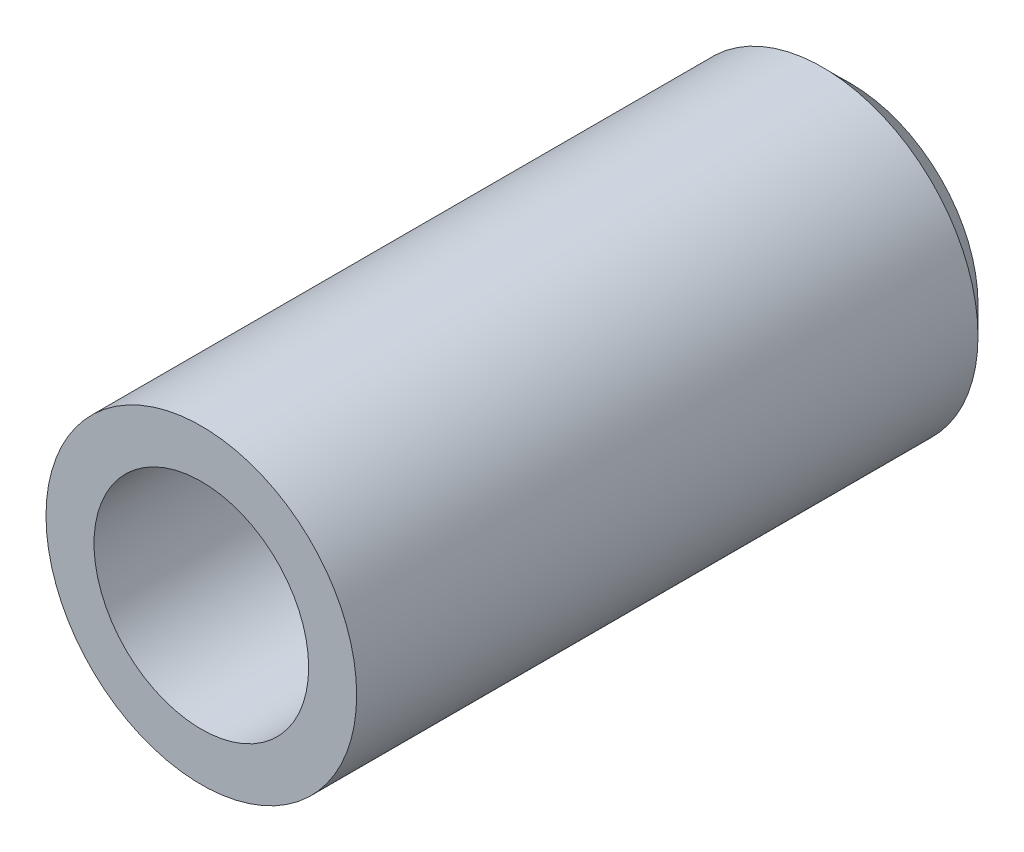
ISO-10303-21;
HEADER;
FILE_DESCRIPTION(('STEP AP214'),'2;1');
FILE_NAME('part.step','',(''),(''),'','','');
FILE_SCHEMA(('AUTOMOTIVE_DESIGN { 1 0 10303 214 1 1 1 1 }'));
ENDSEC;
DATA;
#1=APPLICATION_CONTEXT('core data for automotive mechanical design processes');
#2=APPLICATION_PROTOCOL_DEFINITION('international standard','automotive_design',2000,#1);
#3=PRODUCT_CONTEXT('',#1,'mechanical');
#4=PRODUCT('Part','Part','',(#3));
#5=PRODUCT_RELATED_PRODUCT_CATEGORY('part','',(#4));
#6=PRODUCT_DEFINITION_FORMATION('','',#4);
#7=PRODUCT_DEFINITION_CONTEXT('part definition',#1,'design');
#8=PRODUCT_DEFINITION('design','',#6,#7);
#9=PRODUCT_DEFINITION_SHAPE('','',#8);
#10=(LENGTH_UNIT() NAMED_UNIT(*) SI_UNIT(.MILLI.,.METRE.));
#11=(NAMED_UNIT(*) PLANE_ANGLE_UNIT() SI_UNIT($,.RADIAN.));
#12=(NAMED_UNIT(*) SI_UNIT($,.STERADIAN.) SOLID_ANGLE_UNIT());
#13=UNCERTAINTY_MEASURE_WITH_UNIT(LENGTH_MEASURE(1.E-05),#10,'distance_accuracy_value','');
#14=(GEOMETRIC_REPRESENTATION_CONTEXT(3) GLOBAL_UNCERTAINTY_ASSIGNED_CONTEXT((#13)) GLOBAL_UNIT_ASSIGNED_CONTEXT((#10,
#11,#12)) REPRESENTATION_CONTEXT('',''));
#15=CARTESIAN_POINT('',(0.,0.,0.));
#16=DIRECTION('',(0.,0.,1.));
#17=DIRECTION('',(1.,0.,0.));
#18=AXIS2_PLACEMENT_3D('',#15,#16,#17);
#19=CARTESIAN_POINT('',(1.66533453693773E-13,0.,115.000000000001));
#20=DIRECTION('',(0.,0.,1.00000000000002));
#21=DIRECTION('',(0.999999999999998,0.,0.));
#22=AXIS2_PLACEMENT_3D('',#19,#20,#21);
#23=PLANE('',#22);
#24=CARTESIAN_POINT('',(1.66533453693773E-13,0.,115.000000000001));
#25=DIRECTION('',(0.,0.,1.00000000000002));
#26=DIRECTION('',(0.999999999999998,0.,0.));
#27=AXIS2_PLACEMENT_3D('',#24,#25,#26);
#28=CIRCLE('',#27,27.5);
#29=CARTESIAN_POINT('',(27.5000000000001,0.,115.000000000001));
#30=VERTEX_POINT('',#29);
#31=EDGE_CURVE('E54',#30,#30,#28,.T.);
#32=ORIENTED_EDGE('',*,*,#31,.T.);
#33=EDGE_LOOP('',(#32));
#34=FACE_BOUND('',#33,.T.);
#35=CARTESIAN_POINT('',(1.66533453693773E-13,0.,115.000000000001));
#36=DIRECTION('',(0.,0.,1.00000000000002));
#37=DIRECTION('',(0.999999999999998,0.,0.));
#38=AXIS2_PLACEMENT_3D('',#35,#36,#37);
#39=CIRCLE('',#38,19.);
#40=CARTESIAN_POINT('',(19.0000000000001,0.,115.000000000001));
#41=VERTEX_POINT('',#40);
#42=EDGE_CURVE('E60',#41,#41,#39,.T.);
#43=ORIENTED_EDGE('',*,*,#42,.F.);
#44=EDGE_LOOP('',(#43));
#45=FACE_BOUND('',#44,.T.);
#46=ADVANCED_FACE('F40',(#34,#45),#23,.T.);
#47=CARTESIAN_POINT('',(0.,0.,0.));
#48=DIRECTION('',(0.,0.,1.00000000000002));
#49=DIRECTION('',(0.999999999999998,0.,0.));
#50=AXIS2_PLACEMENT_3D('',#47,#48,#49);
#51=PLANE('',#50);
#52=CARTESIAN_POINT('',(0.,0.,0.));
#53=DIRECTION('',(0.,0.,1.00000000000002));
#54=DIRECTION('',(0.999999999999998,0.,0.));
#55=AXIS2_PLACEMENT_3D('',#52,#53,#54);
#56=CIRCLE('',#55,22.5);
#57=CARTESIAN_POINT('',(22.4999999999999,0.,0.));
#58=VERTEX_POINT('',#57);
#59=EDGE_CURVE('E10',#58,#58,#56,.F.);
#60=ORIENTED_EDGE('',*,*,#59,.T.);
#61=EDGE_LOOP('',(#60));
#62=FACE_BOUND('',#61,.T.);
#63=CARTESIAN_POINT('',(0.,0.,0.));
#64=DIRECTION('',(0.,0.,1.00000000000002));
#65=DIRECTION('',(0.999999999999998,0.,0.));
#66=AXIS2_PLACEMENT_3D('',#63,#64,#65);
#67=CIRCLE('',#66,19.);
#68=CARTESIAN_POINT('',(19.,0.,0.));
#69=VERTEX_POINT('',#68);
#70=EDGE_CURVE('E63',#69,#69,#67,.T.);
#71=ORIENTED_EDGE('',*,*,#70,.T.);
#72=EDGE_LOOP('',(#71));
#73=FACE_BOUND('',#72,.T.);
#74=ADVANCED_FACE('F76',(#62,#73),#51,.F.);
#75=CARTESIAN_POINT('',(1.66533453693773E-13,0.,115.000000000001));
#76=DIRECTION('',(0.,0.,-1.00000000000002));
#77=DIRECTION('',(-0.999999999999998,0.,0.));
#78=AXIS2_PLACEMENT_3D('',#75,#76,#77);
#79=CYLINDRICAL_SURFACE('',#78,27.5);
#80=CARTESIAN_POINT('',(-1.11022302462516E-13,3.33066907387547E-13,5.00000000000012));
#81=DIRECTION('',(0.,0.,1.00000000000002));
#82=DIRECTION('',(0.999999999999998,0.,0.));
#83=AXIS2_PLACEMENT_3D('',#80,#81,#82);
#84=CIRCLE('',#83,27.5);
#85=CARTESIAN_POINT('',(27.4999999999998,3.30013794069828E-13,5.00000000000011));
#86=VERTEX_POINT('',#85);
#87=EDGE_CURVE('E48',#86,#86,#84,.T.);
#88=ORIENTED_EDGE('',*,*,#87,.T.);
#89=EDGE_LOOP('',(#88));
#90=FACE_BOUND('',#89,.T.);
#91=ORIENTED_EDGE('',*,*,#31,.F.);
#92=EDGE_LOOP('',(#91));
#93=FACE_BOUND('',#92,.T.);
#94=ADVANCED_FACE('F82',(#90,#93),#79,.T.);
#95=CARTESIAN_POINT('',(1.66533453693773E-13,0.,115.000000000001));
#96=DIRECTION('',(0.,0.,-1.00000000000002));
#97=DIRECTION('',(-0.999999999999998,0.,0.));
#98=AXIS2_PLACEMENT_3D('',#95,#96,#97);
#99=CYLINDRICAL_SURFACE('',#98,19.);
#100=ORIENTED_EDGE('',*,*,#42,.T.);
#101=EDGE_LOOP('',(#100));
#102=FACE_BOUND('',#101,.T.);
#103=ORIENTED_EDGE('',*,*,#70,.F.);
#104=EDGE_LOOP('',(#103));
#105=FACE_BOUND('',#104,.T.);
#106=ADVANCED_FACE('F72',(#102,#105),#99,.F.);
#107=CARTESIAN_POINT('',(-1.11022302462516E-13,3.33066907387547E-13,5.00000000000012));
#108=DIRECTION('',(0.,0.,1.00000000000002));
#109=DIRECTION('',(0.999999999999998,0.,0.));
#110=AXIS2_PLACEMENT_3D('',#107,#108,#109);
#111=CONICAL_SURFACE('',#110,27.5,0.785398163397451);
#112=ORIENTED_EDGE('',*,*,#59,.F.);
#113=EDGE_LOOP('',(#112));
#114=FACE_BOUND('',#113,.T.);
#115=ORIENTED_EDGE('',*,*,#87,.F.);
#116=EDGE_LOOP('',(#115));
#117=FACE_BOUND('',#116,.T.);
#118=ADVANCED_FACE('F42',(#114,#117),#111,.T.);
#119=CLOSED_SHELL('',(#46,#74,#94,#106,#118));
#120=MANIFOLD_SOLID_BREP('B2',#119);
#121=ADVANCED_BREP_SHAPE_REPRESENTATION('',(#18,#120),#14);
#122=SHAPE_DEFINITION_REPRESENTATION(#9,#121);
ENDSEC;
END-ISO-10303-21;
